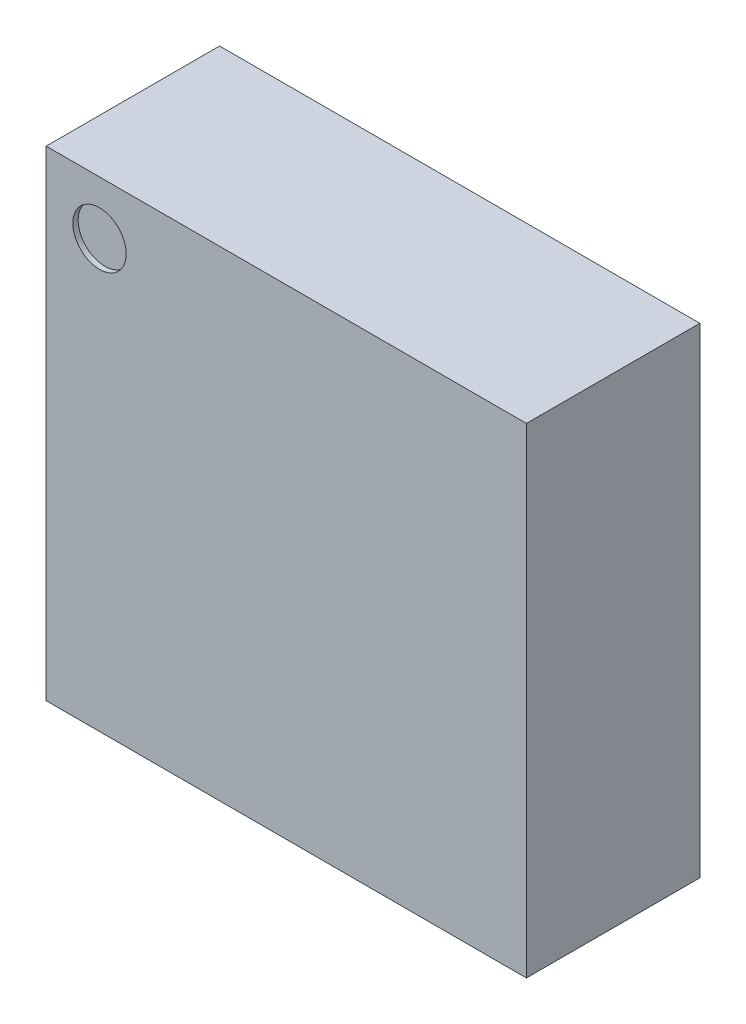
ISO-10303-21;
HEADER;
FILE_DESCRIPTION(('STEP AP214'),'2;1');
FILE_NAME('part.step','',(''),(''),'','','');
FILE_SCHEMA(('AUTOMOTIVE_DESIGN { 1 0 10303 214 1 1 1 1 }'));
ENDSEC;
DATA;
#1=APPLICATION_CONTEXT('core data for automotive mechanical design processes');
#2=APPLICATION_PROTOCOL_DEFINITION('international standard','automotive_design',2000,#1);
#3=PRODUCT_CONTEXT('',#1,'mechanical');
#4=PRODUCT('Part','Part','',(#3));
#5=PRODUCT_RELATED_PRODUCT_CATEGORY('part','',(#4));
#6=PRODUCT_DEFINITION_FORMATION('','',#4);
#7=PRODUCT_DEFINITION_CONTEXT('part definition',#1,'design');
#8=PRODUCT_DEFINITION('design','',#6,#7);
#9=PRODUCT_DEFINITION_SHAPE('','',#8);
#10=(LENGTH_UNIT() NAMED_UNIT(*) SI_UNIT(.MILLI.,.METRE.));
#11=(NAMED_UNIT(*) PLANE_ANGLE_UNIT() SI_UNIT($,.RADIAN.));
#12=(NAMED_UNIT(*) SI_UNIT($,.STERADIAN.) SOLID_ANGLE_UNIT());
#13=UNCERTAINTY_MEASURE_WITH_UNIT(LENGTH_MEASURE(1.E-05),#10,'distance_accuracy_value','');
#14=(GEOMETRIC_REPRESENTATION_CONTEXT(3) GLOBAL_UNCERTAINTY_ASSIGNED_CONTEXT((#13)) GLOBAL_UNIT_ASSIGNED_CONTEXT((#10,
#11,#12)) REPRESENTATION_CONTEXT('',''));
#15=CARTESIAN_POINT('',(0.,0.,0.));
#16=DIRECTION('',(0.,0.,1.));
#17=DIRECTION('',(1.,0.,0.));
#18=AXIS2_PLACEMENT_3D('',#15,#16,#17);
#19=CARTESIAN_POINT('',(0.,-0.4499999999995,0.44625));
#20=DIRECTION('',(0.,0.,1.));
#21=DIRECTION('',(1.,0.,0.));
#22=AXIS2_PLACEMENT_3D('',#19,#20,#21);
#23=PLANE('',#22);
#24=CARTESIAN_POINT('',(-0.35,0.3499999999995,0.44625));
#25=DIRECTION('',(0.,0.,1.));
#26=DIRECTION('',(-1.,0.,0.));
#27=AXIS2_PLACEMENT_3D('',#24,#25,#26);
#28=CIRCLE('',#27,0.05);
#29=CARTESIAN_POINT('',(-0.3,0.3499999999995,0.44625));
#30=VERTEX_POINT('',#29);
#31=EDGE_CURVE('E27',#30,#30,#28,.T.);
#32=ORIENTED_EDGE('',*,*,#31,.T.);
#33=EDGE_LOOP('',(#32));
#34=FACE_BOUND('',#33,.T.);
#35=ADVANCED_FACE('F17',(#34),#23,.T.);
#36=CARTESIAN_POINT('',(-0.35,0.3499999999995,0.45625));
#37=DIRECTION('',(0.,0.,1.));
#38=DIRECTION('',(-1.,0.,0.));
#39=AXIS2_PLACEMENT_3D('',#36,#37,#38);
#40=CYLINDRICAL_SURFACE('',#39,0.05);
#41=ORIENTED_EDGE('',*,*,#31,.F.);
#42=DIRECTION('',(0.,0.,1.));
#43=VECTOR('',#42,1.);
#44=CARTESIAN_POINT('',(-0.3,0.3499999999995,0.45625));
#45=LINE('',#44,#43);
#46=CARTESIAN_POINT('',(-0.3,0.3499999999995,0.45625));
#47=VERTEX_POINT('',#46);
#48=EDGE_CURVE('E11',#30,#47,#45,.T.);
#49=ORIENTED_EDGE('',*,*,#48,.T.);
#50=CARTESIAN_POINT('',(-0.35,0.3499999999995,0.45625));
#51=DIRECTION('',(0.,0.,1.));
#52=DIRECTION('',(-1.,0.,0.));
#53=AXIS2_PLACEMENT_3D('',#50,#51,#52);
#54=CIRCLE('',#53,0.05);
#55=EDGE_CURVE('E125',#47,#47,#54,.T.);
#56=ORIENTED_EDGE('',*,*,#55,.T.);
#57=ORIENTED_EDGE('',*,*,#48,.F.);
#58=EDGE_LOOP('',(#41,#49,#56,#57));
#59=FACE_BOUND('',#58,.T.);
#60=ADVANCED_FACE('F153',(#59),#40,.F.);
#61=CARTESIAN_POINT('',(0.,0.4499999999995,0.));
#62=DIRECTION('',(0.,1.,0.));
#63=DIRECTION('',(1.,0.,0.));
#64=AXIS2_PLACEMENT_3D('',#61,#62,#63);
#65=PLANE('',#64);
#66=DIRECTION('',(0.,0.,-1.));
#67=VECTOR('',#66,1.);
#68=CARTESIAN_POINT('',(0.45,0.4499999999995,0.45625));
#69=LINE('',#68,#67);
#70=CARTESIAN_POINT('',(0.45,0.4499999999995,0.45625));
#71=VERTEX_POINT('',#70);
#72=CARTESIAN_POINT('',(0.45,0.4499999999995,0.13125));
#73=VERTEX_POINT('',#72);
#74=EDGE_CURVE('E99',#71,#73,#69,.T.);
#75=ORIENTED_EDGE('',*,*,#74,.T.);
#76=DIRECTION('',(-1.,0.,0.));
#77=VECTOR('',#76,1.);
#78=CARTESIAN_POINT('',(0.45,0.4499999999995,0.13125));
#79=LINE('',#78,#77);
#80=CARTESIAN_POINT('',(-0.45,0.4499999999995,0.13125));
#81=VERTEX_POINT('',#80);
#82=EDGE_CURVE('E21',#73,#81,#79,.T.);
#83=ORIENTED_EDGE('',*,*,#82,.T.);
#84=DIRECTION('',(0.,0.,1.));
#85=VECTOR('',#84,1.);
#86=CARTESIAN_POINT('',(-0.45,0.4499999999995,0.13125));
#87=LINE('',#86,#85);
#88=CARTESIAN_POINT('',(-0.45,0.4499999999995,0.45625));
#89=VERTEX_POINT('',#88);
#90=EDGE_CURVE('E122',#81,#89,#87,.T.);
#91=ORIENTED_EDGE('',*,*,#90,.T.);
#92=DIRECTION('',(1.,0.,0.));
#93=VECTOR('',#92,1.);
#94=CARTESIAN_POINT('',(-0.45,0.4499999999995,0.45625));
#95=LINE('',#94,#93);
#96=EDGE_CURVE('E101',#89,#71,#95,.T.);
#97=ORIENTED_EDGE('',*,*,#96,.T.);
#98=EDGE_LOOP('',(#75,#83,#91,#97));
#99=FACE_BOUND('',#98,.T.);
#100=ADVANCED_FACE('F19',(#99),#65,.T.);
#101=CARTESIAN_POINT('',(0.45,-0.4499999999995,0.13125));
#102=DIRECTION('',(0.,0.,-1.));
#103=DIRECTION('',(0.,-1.,0.));
#104=AXIS2_PLACEMENT_3D('',#101,#102,#103);
#105=PLANE('',#104);
#106=DIRECTION('',(-1.,0.,0.));
#107=VECTOR('',#106,1.);
#108=CARTESIAN_POINT('',(0.45,-0.4499999999995,0.13125));
#109=LINE('',#108,#107);
#110=CARTESIAN_POINT('',(0.45,-0.4499999999995,0.13125));
#111=VERTEX_POINT('',#110);
#112=CARTESIAN_POINT('',(-0.45,-0.4499999999995,0.13125));
#113=VERTEX_POINT('',#112);
#114=EDGE_CURVE('E112',#111,#113,#109,.T.);
#115=ORIENTED_EDGE('',*,*,#114,.T.);
#116=DIRECTION('',(0.,1.,0.));
#117=VECTOR('',#116,1.);
#118=CARTESIAN_POINT('',(-0.45,-0.4499999999995,0.13125));
#119=LINE('',#118,#117);
#120=EDGE_CURVE('E124',#113,#81,#119,.T.);
#121=ORIENTED_EDGE('',*,*,#120,.T.);
#122=ORIENTED_EDGE('',*,*,#82,.F.);
#123=DIRECTION('',(0.,1.,0.));
#124=VECTOR('',#123,1.);
#125=CARTESIAN_POINT('',(0.45,-0.4499999999995,0.13125));
#126=LINE('',#125,#124);
#127=EDGE_CURVE('E84',#111,#73,#126,.T.);
#128=ORIENTED_EDGE('',*,*,#127,.F.);
#129=EDGE_LOOP('',(#115,#121,#122,#128));
#130=FACE_BOUND('',#129,.T.);
#131=ADVANCED_FACE('F137',(#130),#105,.T.);
#132=CARTESIAN_POINT('',(-0.45,-0.4499999999995,0.13125));
#133=DIRECTION('',(-1.,0.,0.));
#134=DIRECTION('',(0.,0.,1.));
#135=AXIS2_PLACEMENT_3D('',#132,#133,#134);
#136=PLANE('',#135);
#137=DIRECTION('',(0.,0.,1.));
#138=VECTOR('',#137,1.);
#139=CARTESIAN_POINT('',(-0.45,-0.4499999999995,0.13125));
#140=LINE('',#139,#138);
#141=CARTESIAN_POINT('',(-0.45,-0.4499999999995,0.45625));
#142=VERTEX_POINT('',#141);
#143=EDGE_CURVE('E109',#113,#142,#140,.T.);
#144=ORIENTED_EDGE('',*,*,#143,.T.);
#145=DIRECTION('',(0.,1.,0.));
#146=VECTOR('',#145,1.);
#147=CARTESIAN_POINT('',(-0.45,-0.4499999999995,0.45625));
#148=LINE('',#147,#146);
#149=EDGE_CURVE('E72',#142,#89,#148,.T.);
#150=ORIENTED_EDGE('',*,*,#149,.T.);
#151=ORIENTED_EDGE('',*,*,#90,.F.);
#152=ORIENTED_EDGE('',*,*,#120,.F.);
#153=EDGE_LOOP('',(#144,#150,#151,#152));
#154=FACE_BOUND('',#153,.T.);
#155=ADVANCED_FACE('F140',(#154),#136,.T.);
#156=CARTESIAN_POINT('',(-0.45,-0.4499999999995,0.45625));
#157=DIRECTION('',(0.,0.,1.));
#158=DIRECTION('',(1.,0.,0.));
#159=AXIS2_PLACEMENT_3D('',#156,#157,#158);
#160=PLANE('',#159);
#161=ORIENTED_EDGE('',*,*,#55,.F.);
#162=EDGE_LOOP('',(#161));
#163=FACE_BOUND('',#162,.T.);
#164=DIRECTION('',(1.,0.,0.));
#165=VECTOR('',#164,1.);
#166=CARTESIAN_POINT('',(-0.45,-0.4499999999995,0.45625));
#167=LINE('',#166,#165);
#168=CARTESIAN_POINT('',(0.45,-0.4499999999995,0.45625));
#169=VERTEX_POINT('',#168);
#170=EDGE_CURVE('E104',#142,#169,#167,.T.);
#171=ORIENTED_EDGE('',*,*,#170,.T.);
#172=DIRECTION('',(0.,1.,0.));
#173=VECTOR('',#172,1.);
#174=CARTESIAN_POINT('',(0.45,-0.4499999999995,0.45625));
#175=LINE('',#174,#173);
#176=EDGE_CURVE('E95',#169,#71,#175,.T.);
#177=ORIENTED_EDGE('',*,*,#176,.T.);
#178=ORIENTED_EDGE('',*,*,#96,.F.);
#179=ORIENTED_EDGE('',*,*,#149,.F.);
#180=EDGE_LOOP('',(#171,#177,#178,#179));
#181=FACE_BOUND('',#180,.T.);
#182=ADVANCED_FACE('F105',(#163,#181),#160,.T.);
#183=CARTESIAN_POINT('',(0.45,-0.4499999999995,0.45625));
#184=DIRECTION('',(1.,0.,0.));
#185=DIRECTION('',(0.,1.,0.));
#186=AXIS2_PLACEMENT_3D('',#183,#184,#185);
#187=PLANE('',#186);
#188=DIRECTION('',(0.,0.,-1.));
#189=VECTOR('',#188,1.);
#190=CARTESIAN_POINT('',(0.45,-0.4499999999995,0.45625));
#191=LINE('',#190,#189);
#192=EDGE_CURVE('E98',#169,#111,#191,.T.);
#193=ORIENTED_EDGE('',*,*,#192,.T.);
#194=ORIENTED_EDGE('',*,*,#127,.T.);
#195=ORIENTED_EDGE('',*,*,#74,.F.);
#196=ORIENTED_EDGE('',*,*,#176,.F.);
#197=EDGE_LOOP('',(#193,#194,#195,#196));
#198=FACE_BOUND('',#197,.T.);
#199=ADVANCED_FACE('F96',(#198),#187,.T.);
#200=CARTESIAN_POINT('',(0.,-0.4499999999995,0.));
#201=DIRECTION('',(0.,1.,0.));
#202=DIRECTION('',(1.,0.,0.));
#203=AXIS2_PLACEMENT_3D('',#200,#201,#202);
#204=PLANE('',#203);
#205=ORIENTED_EDGE('',*,*,#192,.F.);
#206=ORIENTED_EDGE('',*,*,#170,.F.);
#207=ORIENTED_EDGE('',*,*,#143,.F.);
#208=ORIENTED_EDGE('',*,*,#114,.F.);
#209=EDGE_LOOP('',(#205,#206,#207,#208));
#210=FACE_BOUND('',#209,.T.);
#211=ADVANCED_FACE('F111',(#210),#204,.F.);
#212=CLOSED_SHELL('',(#35,#60,#100,#131,#155,#182,#199,#211));
#213=MANIFOLD_SOLID_BREP('B1',#212);
#214=ADVANCED_BREP_SHAPE_REPRESENTATION('',(#18,#213),#14);
#215=SHAPE_DEFINITION_REPRESENTATION(#9,#214);
ENDSEC;
END-ISO-10303-21;
